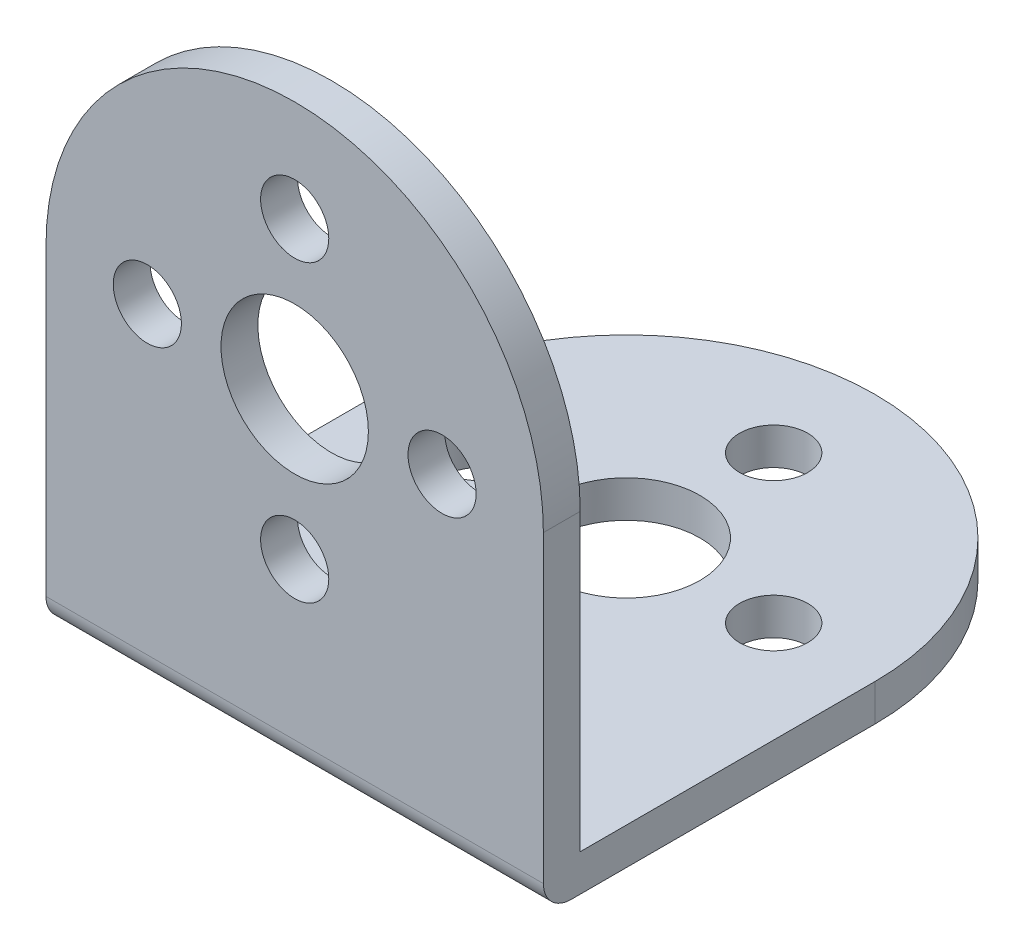
ISO-10303-21;
HEADER;
FILE_DESCRIPTION(('STEP AP214'),'2;1');
FILE_NAME('part.step','',(''),(''),'','','');
FILE_SCHEMA(('AUTOMOTIVE_DESIGN { 1 0 10303 214 1 1 1 1 }'));
ENDSEC;
DATA;
#1=APPLICATION_CONTEXT('core data for automotive mechanical design processes');
#2=APPLICATION_PROTOCOL_DEFINITION('international standard','automotive_design',2000,#1);
#3=PRODUCT_CONTEXT('',#1,'mechanical');
#4=PRODUCT('Part','Part','',(#3));
#5=PRODUCT_RELATED_PRODUCT_CATEGORY('part','',(#4));
#6=PRODUCT_DEFINITION_FORMATION('','',#4);
#7=PRODUCT_DEFINITION_CONTEXT('part definition',#1,'design');
#8=PRODUCT_DEFINITION('design','',#6,#7);
#9=PRODUCT_DEFINITION_SHAPE('','',#8);
#10=(LENGTH_UNIT() NAMED_UNIT(*) SI_UNIT(.MILLI.,.METRE.));
#11=(NAMED_UNIT(*) PLANE_ANGLE_UNIT() SI_UNIT($,.RADIAN.));
#12=(NAMED_UNIT(*) SI_UNIT($,.STERADIAN.) SOLID_ANGLE_UNIT());
#13=UNCERTAINTY_MEASURE_WITH_UNIT(LENGTH_MEASURE(1.E-05),#10,'distance_accuracy_value','');
#14=(GEOMETRIC_REPRESENTATION_CONTEXT(3) GLOBAL_UNCERTAINTY_ASSIGNED_CONTEXT((#13)) GLOBAL_UNIT_ASSIGNED_CONTEXT((#10,
#11,#12)) REPRESENTATION_CONTEXT('',''));
#15=CARTESIAN_POINT('',(0.,0.,0.));
#16=DIRECTION('',(0.,0.,1.));
#17=DIRECTION('',(1.,0.,0.));
#18=AXIS2_PLACEMENT_3D('',#15,#16,#17);
#19=CARTESIAN_POINT('',(0.,2.,-18.));
#20=DIRECTION('',(0.,1.,0.));
#21=DIRECTION('',(0.,0.,1.));
#22=AXIS2_PLACEMENT_3D('',#19,#20,#21);
#23=CYLINDRICAL_SURFACE('',#22,13.5);
#24=DIRECTION('',(0.,-1.,0.));
#25=VECTOR('',#24,1.);
#26=CARTESIAN_POINT('',(-13.5,2.,-18.));
#27=LINE('',#26,#25);
#28=CARTESIAN_POINT('',(-13.5,2.,-18.));
#29=VERTEX_POINT('',#28);
#30=CARTESIAN_POINT('',(-13.5,0.,-18.));
#31=VERTEX_POINT('',#30);
#32=EDGE_CURVE('E151',#29,#31,#27,.T.);
#33=ORIENTED_EDGE('',*,*,#32,.F.);
#34=CARTESIAN_POINT('',(0.,2.,-18.));
#35=DIRECTION('',(0.,1.,0.));
#36=DIRECTION('',(0.,0.,1.));
#37=AXIS2_PLACEMENT_3D('',#34,#35,#36);
#38=CIRCLE('',#37,13.5);
#39=CARTESIAN_POINT('',(13.5,2.,-18.));
#40=VERTEX_POINT('',#39);
#41=EDGE_CURVE('E99',#40,#29,#38,.T.);
#42=ORIENTED_EDGE('',*,*,#41,.F.);
#43=DIRECTION('',(0.,1.,0.));
#44=VECTOR('',#43,1.);
#45=CARTESIAN_POINT('',(13.5,0.,-18.));
#46=LINE('',#45,#44);
#47=CARTESIAN_POINT('',(13.5,0.,-18.));
#48=VERTEX_POINT('',#47);
#49=EDGE_CURVE('E154',#48,#40,#46,.T.);
#50=ORIENTED_EDGE('',*,*,#49,.F.);
#51=CARTESIAN_POINT('',(0.,0.,-18.));
#52=DIRECTION('',(0.,-1.,0.));
#53=DIRECTION('',(0.,0.,-1.));
#54=AXIS2_PLACEMENT_3D('',#51,#52,#53);
#55=CIRCLE('',#54,13.5);
#56=EDGE_CURVE('E160',#31,#48,#55,.T.);
#57=ORIENTED_EDGE('',*,*,#56,.F.);
#58=EDGE_LOOP('',(#33,#42,#50,#57));
#59=FACE_BOUND('',#58,.T.);
#60=ADVANCED_FACE('F16',(#59),#23,.T.);
#61=CARTESIAN_POINT('',(0.,18.,-2.));
#62=DIRECTION('',(0.,0.,1.));
#63=DIRECTION('',(1.,0.,0.));
#64=AXIS2_PLACEMENT_3D('',#61,#62,#63);
#65=CYLINDRICAL_SURFACE('',#64,13.5);
#66=DIRECTION('',(0.,0.,1.));
#67=VECTOR('',#66,1.);
#68=CARTESIAN_POINT('',(13.5,18.,0.));
#69=LINE('',#68,#67);
#70=CARTESIAN_POINT('',(13.5,18.,-2.));
#71=VERTEX_POINT('',#70);
#72=CARTESIAN_POINT('',(13.5,18.,0.));
#73=VERTEX_POINT('',#72);
#74=EDGE_CURVE('E114',#71,#73,#69,.T.);
#75=ORIENTED_EDGE('',*,*,#74,.F.);
#76=CARTESIAN_POINT('',(0.,18.,-2.));
#77=DIRECTION('',(0.,0.,-1.));
#78=DIRECTION('',(0.,1.,0.));
#79=AXIS2_PLACEMENT_3D('',#76,#77,#78);
#80=CIRCLE('',#79,13.5);
#81=CARTESIAN_POINT('',(-13.5,18.,-2.));
#82=VERTEX_POINT('',#81);
#83=EDGE_CURVE('E145',#82,#71,#80,.T.);
#84=ORIENTED_EDGE('',*,*,#83,.F.);
#85=DIRECTION('',(0.,0.,-1.));
#86=VECTOR('',#85,1.);
#87=CARTESIAN_POINT('',(-13.5,18.,-2.));
#88=LINE('',#87,#86);
#89=CARTESIAN_POINT('',(-13.5,18.,0.));
#90=VERTEX_POINT('',#89);
#91=EDGE_CURVE('E120',#90,#82,#88,.T.);
#92=ORIENTED_EDGE('',*,*,#91,.F.);
#93=CARTESIAN_POINT('',(0.,18.,0.));
#94=DIRECTION('',(0.,0.,1.));
#95=DIRECTION('',(0.,-1.,0.));
#96=AXIS2_PLACEMENT_3D('',#93,#94,#95);
#97=CIRCLE('',#96,13.5);
#98=EDGE_CURVE('E148',#73,#90,#97,.T.);
#99=ORIENTED_EDGE('',*,*,#98,.F.);
#100=EDGE_LOOP('',(#75,#84,#92,#99));
#101=FACE_BOUND('',#100,.T.);
#102=ADVANCED_FACE('F530',(#101),#65,.T.);
#103=CARTESIAN_POINT('',(-13.5,31.5,0.));
#104=DIRECTION('',(0.,0.,1.));
#105=DIRECTION('',(0.,-1.,0.));
#106=AXIS2_PLACEMENT_3D('',#103,#104,#105);
#107=PLANE('',#106);
#108=CARTESIAN_POINT('',(0.,26.,0.));
#109=DIRECTION('',(0.,0.,1.));
#110=DIRECTION('',(1.,0.,0.));
#111=AXIS2_PLACEMENT_3D('',#108,#109,#110);
#112=CIRCLE('',#111,1.85);
#113=CARTESIAN_POINT('',(1.85,26.,0.));
#114=VERTEX_POINT('',#113);
#115=EDGE_CURVE('E261',#114,#114,#112,.T.);
#116=ORIENTED_EDGE('',*,*,#115,.F.);
#117=EDGE_LOOP('',(#116));
#118=FACE_BOUND('',#117,.T.);
#119=CARTESIAN_POINT('',(0.,10.,0.));
#120=DIRECTION('',(0.,0.,1.));
#121=DIRECTION('',(1.,0.,0.));
#122=AXIS2_PLACEMENT_3D('',#119,#120,#121);
#123=CIRCLE('',#122,1.85);
#124=CARTESIAN_POINT('',(1.85,10.,0.));
#125=VERTEX_POINT('',#124);
#126=EDGE_CURVE('E248',#125,#125,#123,.T.);
#127=ORIENTED_EDGE('',*,*,#126,.F.);
#128=EDGE_LOOP('',(#127));
#129=FACE_BOUND('',#128,.T.);
#130=CARTESIAN_POINT('',(-8.,18.,0.));
#131=DIRECTION('',(0.,0.,1.));
#132=DIRECTION('',(1.,0.,0.));
#133=AXIS2_PLACEMENT_3D('',#130,#131,#132);
#134=CIRCLE('',#133,1.85);
#135=CARTESIAN_POINT('',(-6.15,18.,0.));
#136=VERTEX_POINT('',#135);
#137=EDGE_CURVE('E235',#136,#136,#134,.T.);
#138=ORIENTED_EDGE('',*,*,#137,.F.);
#139=EDGE_LOOP('',(#138));
#140=FACE_BOUND('',#139,.T.);
#141=CARTESIAN_POINT('',(8.,18.,0.));
#142=DIRECTION('',(0.,0.,1.));
#143=DIRECTION('',(1.,0.,0.));
#144=AXIS2_PLACEMENT_3D('',#141,#142,#143);
#145=CIRCLE('',#144,1.85);
#146=CARTESIAN_POINT('',(9.85,18.,0.));
#147=VERTEX_POINT('',#146);
#148=EDGE_CURVE('E222',#147,#147,#145,.T.);
#149=ORIENTED_EDGE('',*,*,#148,.F.);
#150=EDGE_LOOP('',(#149));
#151=FACE_BOUND('',#150,.T.);
#152=CARTESIAN_POINT('',(0.,18.,0.));
#153=DIRECTION('',(0.,0.,1.));
#154=DIRECTION('',(1.,0.,0.));
#155=AXIS2_PLACEMENT_3D('',#152,#153,#154);
#156=CIRCLE('',#155,4.);
#157=CARTESIAN_POINT('',(4.,18.,0.));
#158=VERTEX_POINT('',#157);
#159=EDGE_CURVE('E131',#158,#158,#156,.T.);
#160=ORIENTED_EDGE('',*,*,#159,.F.);
#161=EDGE_LOOP('',(#160));
#162=FACE_BOUND('',#161,.T.);
#163=DIRECTION('',(0.,-1.,0.));
#164=VECTOR('',#163,1.);
#165=CARTESIAN_POINT('',(-13.5,31.5,0.));
#166=LINE('',#165,#164);
#167=CARTESIAN_POINT('',(-13.5,1.5,0.));
#168=VERTEX_POINT('',#167);
#169=EDGE_CURVE('E138',#90,#168,#166,.T.);
#170=ORIENTED_EDGE('',*,*,#169,.T.);
#171=DIRECTION('',(1.,0.,0.));
#172=VECTOR('',#171,1.);
#173=CARTESIAN_POINT('',(-13.5,1.5,0.));
#174=LINE('',#173,#172);
#175=CARTESIAN_POINT('',(13.5,1.5,0.));
#176=VERTEX_POINT('',#175);
#177=EDGE_CURVE('E164',#168,#176,#174,.T.);
#178=ORIENTED_EDGE('',*,*,#177,.T.);
#179=DIRECTION('',(0.,-1.,0.));
#180=VECTOR('',#179,1.);
#181=CARTESIAN_POINT('',(13.5,31.5,0.));
#182=LINE('',#181,#180);
#183=EDGE_CURVE('E127',#73,#176,#182,.T.);
#184=ORIENTED_EDGE('',*,*,#183,.F.);
#185=ORIENTED_EDGE('',*,*,#98,.T.);
#186=EDGE_LOOP('',(#170,#178,#184,#185));
#187=FACE_BOUND('',#186,.T.);
#188=ADVANCED_FACE('F520',(#118,#129,#140,#151,#162,#187),#107,.T.);
#189=CARTESIAN_POINT('',(-13.5,2.,-2.));
#190=DIRECTION('',(0.,0.,-1.));
#191=DIRECTION('',(0.,1.,0.));
#192=AXIS2_PLACEMENT_3D('',#189,#190,#191);
#193=PLANE('',#192);
#194=CARTESIAN_POINT('',(0.,26.,-2.));
#195=DIRECTION('',(0.,0.,-1.));
#196=DIRECTION('',(0.,1.,0.));
#197=AXIS2_PLACEMENT_3D('',#194,#195,#196);
#198=CIRCLE('',#197,1.85);
#199=CARTESIAN_POINT('',(0.,27.85,-2.));
#200=VERTEX_POINT('',#199);
#201=EDGE_CURVE('E270',#200,#200,#198,.T.);
#202=ORIENTED_EDGE('',*,*,#201,.F.);
#203=EDGE_LOOP('',(#202));
#204=FACE_BOUND('',#203,.T.);
#205=CARTESIAN_POINT('',(0.,10.,-2.));
#206=DIRECTION('',(0.,0.,-1.));
#207=DIRECTION('',(0.,1.,0.));
#208=AXIS2_PLACEMENT_3D('',#205,#206,#207);
#209=CIRCLE('',#208,1.85);
#210=CARTESIAN_POINT('',(0.,11.85,-2.));
#211=VERTEX_POINT('',#210);
#212=EDGE_CURVE('E257',#211,#211,#209,.T.);
#213=ORIENTED_EDGE('',*,*,#212,.F.);
#214=EDGE_LOOP('',(#213));
#215=FACE_BOUND('',#214,.T.);
#216=CARTESIAN_POINT('',(-8.,18.,-2.));
#217=DIRECTION('',(0.,0.,-1.));
#218=DIRECTION('',(0.,1.,0.));
#219=AXIS2_PLACEMENT_3D('',#216,#217,#218);
#220=CIRCLE('',#219,1.85);
#221=CARTESIAN_POINT('',(-8.,19.85,-2.));
#222=VERTEX_POINT('',#221);
#223=EDGE_CURVE('E244',#222,#222,#220,.T.);
#224=ORIENTED_EDGE('',*,*,#223,.F.);
#225=EDGE_LOOP('',(#224));
#226=FACE_BOUND('',#225,.T.);
#227=CARTESIAN_POINT('',(8.,18.,-2.));
#228=DIRECTION('',(0.,0.,-1.));
#229=DIRECTION('',(0.,1.,0.));
#230=AXIS2_PLACEMENT_3D('',#227,#228,#229);
#231=CIRCLE('',#230,1.85);
#232=CARTESIAN_POINT('',(8.,19.85,-2.));
#233=VERTEX_POINT('',#232);
#234=EDGE_CURVE('E231',#233,#233,#231,.T.);
#235=ORIENTED_EDGE('',*,*,#234,.F.);
#236=EDGE_LOOP('',(#235));
#237=FACE_BOUND('',#236,.T.);
#238=CARTESIAN_POINT('',(0.,18.,-2.));
#239=DIRECTION('',(0.,0.,-1.));
#240=DIRECTION('',(0.,1.,0.));
#241=AXIS2_PLACEMENT_3D('',#238,#239,#240);
#242=CIRCLE('',#241,4.);
#243=CARTESIAN_POINT('',(0.,22.,-2.));
#244=VERTEX_POINT('',#243);
#245=EDGE_CURVE('E218',#244,#244,#242,.T.);
#246=ORIENTED_EDGE('',*,*,#245,.F.);
#247=EDGE_LOOP('',(#246));
#248=FACE_BOUND('',#247,.T.);
#249=DIRECTION('',(0.,1.,0.));
#250=VECTOR('',#249,1.);
#251=CARTESIAN_POINT('',(-13.5,2.,-2.));
#252=LINE('',#251,#250);
#253=CARTESIAN_POINT('',(-13.5,2.,-2.));
#254=VERTEX_POINT('',#253);
#255=EDGE_CURVE('E105',#254,#82,#252,.T.);
#256=ORIENTED_EDGE('',*,*,#255,.T.);
#257=ORIENTED_EDGE('',*,*,#83,.T.);
#258=DIRECTION('',(0.,1.,0.));
#259=VECTOR('',#258,1.);
#260=CARTESIAN_POINT('',(13.5,2.,-2.));
#261=LINE('',#260,#259);
#262=CARTESIAN_POINT('',(13.5,2.,-2.));
#263=VERTEX_POINT('',#262);
#264=EDGE_CURVE('E112',#263,#71,#261,.T.);
#265=ORIENTED_EDGE('',*,*,#264,.F.);
#266=DIRECTION('',(1.,0.,0.));
#267=VECTOR('',#266,1.);
#268=CARTESIAN_POINT('',(-13.5,2.,-2.));
#269=LINE('',#268,#267);
#270=EDGE_CURVE('E97',#254,#263,#269,.T.);
#271=ORIENTED_EDGE('',*,*,#270,.F.);
#272=EDGE_LOOP('',(#256,#257,#265,#271));
#273=FACE_BOUND('',#272,.T.);
#274=ADVANCED_FACE('F110',(#204,#215,#226,#237,#248,#273),#193,.T.);
#275=CARTESIAN_POINT('',(-13.5,2.,-31.5));
#276=DIRECTION('',(0.,1.,0.));
#277=DIRECTION('',(0.,0.,1.));
#278=AXIS2_PLACEMENT_3D('',#275,#276,#277);
#279=PLANE('',#278);
#280=CARTESIAN_POINT('',(0.,2.,-10.));
#281=DIRECTION('',(0.,1.,0.));
#282=DIRECTION('',(0.,0.,1.));
#283=AXIS2_PLACEMENT_3D('',#280,#281,#282);
#284=CIRCLE('',#283,1.85);
#285=CARTESIAN_POINT('',(0.,2.,-8.15));
#286=VERTEX_POINT('',#285);
#287=EDGE_CURVE('E335',#286,#286,#284,.T.);
#288=ORIENTED_EDGE('',*,*,#287,.F.);
#289=EDGE_LOOP('',(#288));
#290=FACE_BOUND('',#289,.T.);
#291=CARTESIAN_POINT('',(0.,2.,-26.));
#292=DIRECTION('',(0.,1.,0.));
#293=DIRECTION('',(0.,0.,1.));
#294=AXIS2_PLACEMENT_3D('',#291,#292,#293);
#295=CIRCLE('',#294,1.85);
#296=CARTESIAN_POINT('',(0.,2.,-24.15));
#297=VERTEX_POINT('',#296);
#298=EDGE_CURVE('E322',#297,#297,#295,.T.);
#299=ORIENTED_EDGE('',*,*,#298,.F.);
#300=EDGE_LOOP('',(#299));
#301=FACE_BOUND('',#300,.T.);
#302=CARTESIAN_POINT('',(-8.,2.,-18.));
#303=DIRECTION('',(0.,1.,0.));
#304=DIRECTION('',(0.,0.,1.));
#305=AXIS2_PLACEMENT_3D('',#302,#303,#304);
#306=CIRCLE('',#305,1.85);
#307=CARTESIAN_POINT('',(-8.,2.,-16.15));
#308=VERTEX_POINT('',#307);
#309=EDGE_CURVE('E309',#308,#308,#306,.T.);
#310=ORIENTED_EDGE('',*,*,#309,.F.);
#311=EDGE_LOOP('',(#310));
#312=FACE_BOUND('',#311,.T.);
#313=CARTESIAN_POINT('',(8.,2.,-18.));
#314=DIRECTION('',(0.,1.,0.));
#315=DIRECTION('',(0.,0.,1.));
#316=AXIS2_PLACEMENT_3D('',#313,#314,#315);
#317=CIRCLE('',#316,1.85);
#318=CARTESIAN_POINT('',(8.,2.,-16.15));
#319=VERTEX_POINT('',#318);
#320=EDGE_CURVE('E296',#319,#319,#317,.T.);
#321=ORIENTED_EDGE('',*,*,#320,.F.);
#322=EDGE_LOOP('',(#321));
#323=FACE_BOUND('',#322,.T.);
#324=CARTESIAN_POINT('',(0.,2.,-18.));
#325=DIRECTION('',(0.,1.,0.));
#326=DIRECTION('',(0.,0.,1.));
#327=AXIS2_PLACEMENT_3D('',#324,#325,#326);
#328=CIRCLE('',#327,4.);
#329=CARTESIAN_POINT('',(0.,2.,-14.));
#330=VERTEX_POINT('',#329);
#331=EDGE_CURVE('E283',#330,#330,#328,.T.);
#332=ORIENTED_EDGE('',*,*,#331,.F.);
#333=EDGE_LOOP('',(#332));
#334=FACE_BOUND('',#333,.T.);
#335=DIRECTION('',(0.,0.,1.));
#336=VECTOR('',#335,1.);
#337=CARTESIAN_POINT('',(13.5,2.,-31.5));
#338=LINE('',#337,#336);
#339=EDGE_CURVE('E134',#40,#263,#338,.T.);
#340=ORIENTED_EDGE('',*,*,#339,.F.);
#341=ORIENTED_EDGE('',*,*,#41,.T.);
#342=DIRECTION('',(0.,0.,1.));
#343=VECTOR('',#342,1.);
#344=CARTESIAN_POINT('',(-13.5,2.,-31.5));
#345=LINE('',#344,#343);
#346=EDGE_CURVE('E93',#29,#254,#345,.T.);
#347=ORIENTED_EDGE('',*,*,#346,.T.);
#348=ORIENTED_EDGE('',*,*,#270,.T.);
#349=EDGE_LOOP('',(#340,#341,#347,#348));
#350=FACE_BOUND('',#349,.T.);
#351=ADVANCED_FACE('F96',(#290,#301,#312,#323,#334,#350),#279,.T.);
#352=CARTESIAN_POINT('',(-13.5,0.,0.));
#353=DIRECTION('',(0.,-1.,0.));
#354=DIRECTION('',(0.,0.,-1.));
#355=AXIS2_PLACEMENT_3D('',#352,#353,#354);
#356=PLANE('',#355);
#357=CARTESIAN_POINT('',(0.,0.,-10.));
#358=DIRECTION('',(0.,-1.,0.));
#359=DIRECTION('',(0.,0.,-1.));
#360=AXIS2_PLACEMENT_3D('',#357,#358,#359);
#361=CIRCLE('',#360,1.85);
#362=CARTESIAN_POINT('',(0.,0.,-11.85));
#363=VERTEX_POINT('',#362);
#364=EDGE_CURVE('E326',#363,#363,#361,.T.);
#365=ORIENTED_EDGE('',*,*,#364,.F.);
#366=EDGE_LOOP('',(#365));
#367=FACE_BOUND('',#366,.T.);
#368=CARTESIAN_POINT('',(0.,0.,-26.));
#369=DIRECTION('',(0.,-1.,0.));
#370=DIRECTION('',(0.,0.,-1.));
#371=AXIS2_PLACEMENT_3D('',#368,#369,#370);
#372=CIRCLE('',#371,1.85);
#373=CARTESIAN_POINT('',(0.,0.,-27.85));
#374=VERTEX_POINT('',#373);
#375=EDGE_CURVE('E313',#374,#374,#372,.T.);
#376=ORIENTED_EDGE('',*,*,#375,.F.);
#377=EDGE_LOOP('',(#376));
#378=FACE_BOUND('',#377,.T.);
#379=CARTESIAN_POINT('',(-8.,0.,-18.));
#380=DIRECTION('',(0.,-1.,0.));
#381=DIRECTION('',(0.,0.,-1.));
#382=AXIS2_PLACEMENT_3D('',#379,#380,#381);
#383=CIRCLE('',#382,1.85);
#384=CARTESIAN_POINT('',(-8.,0.,-19.85));
#385=VERTEX_POINT('',#384);
#386=EDGE_CURVE('E300',#385,#385,#383,.T.);
#387=ORIENTED_EDGE('',*,*,#386,.F.);
#388=EDGE_LOOP('',(#387));
#389=FACE_BOUND('',#388,.T.);
#390=CARTESIAN_POINT('',(8.,0.,-18.));
#391=DIRECTION('',(0.,-1.,0.));
#392=DIRECTION('',(0.,0.,-1.));
#393=AXIS2_PLACEMENT_3D('',#390,#391,#392);
#394=CIRCLE('',#393,1.85);
#395=CARTESIAN_POINT('',(8.,0.,-19.85));
#396=VERTEX_POINT('',#395);
#397=EDGE_CURVE('E287',#396,#396,#394,.T.);
#398=ORIENTED_EDGE('',*,*,#397,.F.);
#399=EDGE_LOOP('',(#398));
#400=FACE_BOUND('',#399,.T.);
#401=CARTESIAN_POINT('',(0.,0.,-18.));
#402=DIRECTION('',(0.,-1.,0.));
#403=DIRECTION('',(0.,0.,-1.));
#404=AXIS2_PLACEMENT_3D('',#401,#402,#403);
#405=CIRCLE('',#404,4.);
#406=CARTESIAN_POINT('',(0.,0.,-22.));
#407=VERTEX_POINT('',#406);
#408=EDGE_CURVE('E274',#407,#407,#405,.T.);
#409=ORIENTED_EDGE('',*,*,#408,.F.);
#410=EDGE_LOOP('',(#409));
#411=FACE_BOUND('',#410,.T.);
#412=DIRECTION('',(0.,0.,-1.));
#413=VECTOR('',#412,1.);
#414=CARTESIAN_POINT('',(13.5,0.,0.));
#415=LINE('',#414,#413);
#416=CARTESIAN_POINT('',(13.5,0.,-1.5));
#417=VERTEX_POINT('',#416);
#418=EDGE_CURVE('E130',#417,#48,#415,.T.);
#419=ORIENTED_EDGE('',*,*,#418,.F.);
#420=DIRECTION('',(1.,0.,0.));
#421=VECTOR('',#420,1.);
#422=CARTESIAN_POINT('',(-13.5,0.,-1.5));
#423=LINE('',#422,#421);
#424=CARTESIAN_POINT('',(-13.5,0.,-1.5));
#425=VERTEX_POINT('',#424);
#426=EDGE_CURVE('E25',#417,#425,#423,.F.);
#427=ORIENTED_EDGE('',*,*,#426,.T.);
#428=DIRECTION('',(0.,0.,-1.));
#429=VECTOR('',#428,1.);
#430=CARTESIAN_POINT('',(-13.5,0.,0.));
#431=LINE('',#430,#429);
#432=EDGE_CURVE('E106',#425,#31,#431,.T.);
#433=ORIENTED_EDGE('',*,*,#432,.T.);
#434=ORIENTED_EDGE('',*,*,#56,.T.);
#435=EDGE_LOOP('',(#419,#427,#433,#434));
#436=FACE_BOUND('',#435,.T.);
#437=ADVANCED_FACE('F490',(#367,#378,#389,#400,#411,#436),#356,.T.);
#438=CARTESIAN_POINT('',(-13.5,0.,0.));
#439=DIRECTION('',(1.,0.,0.));
#440=DIRECTION('',(0.,0.,-1.));
#441=AXIS2_PLACEMENT_3D('',#438,#439,#440);
#442=PLANE('',#441);
#443=ORIENTED_EDGE('',*,*,#432,.F.);
#444=CARTESIAN_POINT('',(-13.5,1.5,-1.5));
#445=DIRECTION('',(1.,0.,0.));
#446=DIRECTION('',(0.,0.,-1.));
#447=AXIS2_PLACEMENT_3D('',#444,#445,#446);
#448=CIRCLE('',#447,1.5);
#449=EDGE_CURVE('E10',#425,#168,#448,.F.);
#450=ORIENTED_EDGE('',*,*,#449,.T.);
#451=ORIENTED_EDGE('',*,*,#169,.F.);
#452=ORIENTED_EDGE('',*,*,#91,.T.);
#453=ORIENTED_EDGE('',*,*,#255,.F.);
#454=ORIENTED_EDGE('',*,*,#346,.F.);
#455=ORIENTED_EDGE('',*,*,#32,.T.);
#456=EDGE_LOOP('',(#443,#450,#451,#452,#453,#454,#455));
#457=FACE_BOUND('',#456,.T.);
#458=ADVANCED_FACE('F117',(#457),#442,.F.);
#459=CARTESIAN_POINT('',(13.5,0.,0.));
#460=DIRECTION('',(1.,0.,0.));
#461=DIRECTION('',(0.,0.,-1.));
#462=AXIS2_PLACEMENT_3D('',#459,#460,#461);
#463=PLANE('',#462);
#464=ORIENTED_EDGE('',*,*,#183,.T.);
#465=CARTESIAN_POINT('',(13.5,1.5,-1.5));
#466=DIRECTION('',(1.,0.,0.));
#467=DIRECTION('',(0.,0.,-1.));
#468=AXIS2_PLACEMENT_3D('',#465,#466,#467);
#469=CIRCLE('',#468,1.5);
#470=EDGE_CURVE('E46',#176,#417,#469,.T.);
#471=ORIENTED_EDGE('',*,*,#470,.T.);
#472=ORIENTED_EDGE('',*,*,#418,.T.);
#473=ORIENTED_EDGE('',*,*,#49,.T.);
#474=ORIENTED_EDGE('',*,*,#339,.T.);
#475=ORIENTED_EDGE('',*,*,#264,.T.);
#476=ORIENTED_EDGE('',*,*,#74,.T.);
#477=EDGE_LOOP('',(#464,#471,#472,#473,#474,#475,#476));
#478=FACE_BOUND('',#477,.T.);
#479=ADVANCED_FACE('F468',(#478),#463,.T.);
#480=CARTESIAN_POINT('',(-13.5,1.5,-1.5));
#481=DIRECTION('',(1.,0.,0.));
#482=DIRECTION('',(0.,0.,-1.));
#483=AXIS2_PLACEMENT_3D('',#480,#481,#482);
#484=CYLINDRICAL_SURFACE('',#483,1.5);
#485=ORIENTED_EDGE('',*,*,#449,.F.);
#486=ORIENTED_EDGE('',*,*,#426,.F.);
#487=ORIENTED_EDGE('',*,*,#470,.F.);
#488=ORIENTED_EDGE('',*,*,#177,.F.);
#489=EDGE_LOOP('',(#485,#486,#487,#488));
#490=FACE_BOUND('',#489,.T.);
#491=ADVANCED_FACE('F18',(#490),#484,.T.);
#492=CARTESIAN_POINT('',(0.,18.,-31.5));
#493=DIRECTION('',(0.,0.,1.));
#494=DIRECTION('',(1.,0.,0.));
#495=AXIS2_PLACEMENT_3D('',#492,#493,#494);
#496=CYLINDRICAL_SURFACE('',#495,4.);
#497=ORIENTED_EDGE('',*,*,#245,.T.);
#498=EDGE_LOOP('',(#497));
#499=FACE_BOUND('',#498,.T.);
#500=ORIENTED_EDGE('',*,*,#159,.T.);
#501=EDGE_LOOP('',(#500));
#502=FACE_BOUND('',#501,.T.);
#503=ADVANCED_FACE('F446',(#499,#502),#496,.F.);
#504=CARTESIAN_POINT('',(8.,18.,-31.5));
#505=DIRECTION('',(0.,0.,1.));
#506=DIRECTION('',(1.,0.,0.));
#507=AXIS2_PLACEMENT_3D('',#504,#505,#506);
#508=CYLINDRICAL_SURFACE('',#507,1.85);
#509=ORIENTED_EDGE('',*,*,#234,.T.);
#510=EDGE_LOOP('',(#509));
#511=FACE_BOUND('',#510,.T.);
#512=ORIENTED_EDGE('',*,*,#148,.T.);
#513=EDGE_LOOP('',(#512));
#514=FACE_BOUND('',#513,.T.);
#515=ADVANCED_FACE('F435',(#511,#514),#508,.F.);
#516=CARTESIAN_POINT('',(-8.,18.,-31.5));
#517=DIRECTION('',(0.,0.,1.));
#518=DIRECTION('',(1.,0.,0.));
#519=AXIS2_PLACEMENT_3D('',#516,#517,#518);
#520=CYLINDRICAL_SURFACE('',#519,1.85);
#521=ORIENTED_EDGE('',*,*,#223,.T.);
#522=EDGE_LOOP('',(#521));
#523=FACE_BOUND('',#522,.T.);
#524=ORIENTED_EDGE('',*,*,#137,.T.);
#525=EDGE_LOOP('',(#524));
#526=FACE_BOUND('',#525,.T.);
#527=ADVANCED_FACE('F424',(#523,#526),#520,.F.);
#528=CARTESIAN_POINT('',(0.,10.,-31.5));
#529=DIRECTION('',(0.,0.,1.));
#530=DIRECTION('',(1.,0.,0.));
#531=AXIS2_PLACEMENT_3D('',#528,#529,#530);
#532=CYLINDRICAL_SURFACE('',#531,1.85);
#533=ORIENTED_EDGE('',*,*,#212,.T.);
#534=EDGE_LOOP('',(#533));
#535=FACE_BOUND('',#534,.T.);
#536=ORIENTED_EDGE('',*,*,#126,.T.);
#537=EDGE_LOOP('',(#536));
#538=FACE_BOUND('',#537,.T.);
#539=ADVANCED_FACE('F413',(#535,#538),#532,.F.);
#540=CARTESIAN_POINT('',(0.,26.,-31.5));
#541=DIRECTION('',(0.,0.,1.));
#542=DIRECTION('',(1.,0.,0.));
#543=AXIS2_PLACEMENT_3D('',#540,#541,#542);
#544=CYLINDRICAL_SURFACE('',#543,1.85);
#545=ORIENTED_EDGE('',*,*,#201,.T.);
#546=EDGE_LOOP('',(#545));
#547=FACE_BOUND('',#546,.T.);
#548=ORIENTED_EDGE('',*,*,#115,.T.);
#549=EDGE_LOOP('',(#548));
#550=FACE_BOUND('',#549,.T.);
#551=ADVANCED_FACE('F402',(#547,#550),#544,.F.);
#552=CARTESIAN_POINT('',(0.,31.5,-18.));
#553=DIRECTION('',(0.,-1.,0.));
#554=DIRECTION('',(0.,0.,-1.));
#555=AXIS2_PLACEMENT_3D('',#552,#553,#554);
#556=CYLINDRICAL_SURFACE('',#555,4.);
#557=ORIENTED_EDGE('',*,*,#331,.T.);
#558=EDGE_LOOP('',(#557));
#559=FACE_BOUND('',#558,.T.);
#560=ORIENTED_EDGE('',*,*,#408,.T.);
#561=EDGE_LOOP('',(#560));
#562=FACE_BOUND('',#561,.T.);
#563=ADVANCED_FACE('F391',(#559,#562),#556,.F.);
#564=CARTESIAN_POINT('',(8.,31.5,-18.));
#565=DIRECTION('',(0.,-1.,0.));
#566=DIRECTION('',(0.,0.,-1.));
#567=AXIS2_PLACEMENT_3D('',#564,#565,#566);
#568=CYLINDRICAL_SURFACE('',#567,1.85);
#569=ORIENTED_EDGE('',*,*,#320,.T.);
#570=EDGE_LOOP('',(#569));
#571=FACE_BOUND('',#570,.T.);
#572=ORIENTED_EDGE('',*,*,#397,.T.);
#573=EDGE_LOOP('',(#572));
#574=FACE_BOUND('',#573,.T.);
#575=ADVANCED_FACE('F380',(#571,#574),#568,.F.);
#576=CARTESIAN_POINT('',(-8.,31.5,-18.));
#577=DIRECTION('',(0.,-1.,0.));
#578=DIRECTION('',(0.,0.,-1.));
#579=AXIS2_PLACEMENT_3D('',#576,#577,#578);
#580=CYLINDRICAL_SURFACE('',#579,1.85);
#581=ORIENTED_EDGE('',*,*,#309,.T.);
#582=EDGE_LOOP('',(#581));
#583=FACE_BOUND('',#582,.T.);
#584=ORIENTED_EDGE('',*,*,#386,.T.);
#585=EDGE_LOOP('',(#584));
#586=FACE_BOUND('',#585,.T.);
#587=ADVANCED_FACE('F370',(#583,#586),#580,.F.);
#588=CARTESIAN_POINT('',(0.,31.5,-26.));
#589=DIRECTION('',(0.,-1.,0.));
#590=DIRECTION('',(0.,0.,-1.));
#591=AXIS2_PLACEMENT_3D('',#588,#589,#590);
#592=CYLINDRICAL_SURFACE('',#591,1.85);
#593=ORIENTED_EDGE('',*,*,#298,.T.);
#594=EDGE_LOOP('',(#593));
#595=FACE_BOUND('',#594,.T.);
#596=ORIENTED_EDGE('',*,*,#375,.T.);
#597=EDGE_LOOP('',(#596));
#598=FACE_BOUND('',#597,.T.);
#599=ADVANCED_FACE('F351',(#595,#598),#592,.F.);
#600=CARTESIAN_POINT('',(0.,31.5,-10.));
#601=DIRECTION('',(0.,-1.,0.));
#602=DIRECTION('',(0.,0.,-1.));
#603=AXIS2_PLACEMENT_3D('',#600,#601,#602);
#604=CYLINDRICAL_SURFACE('',#603,1.85);
#605=ORIENTED_EDGE('',*,*,#287,.T.);
#606=EDGE_LOOP('',(#605));
#607=FACE_BOUND('',#606,.T.);
#608=ORIENTED_EDGE('',*,*,#364,.T.);
#609=EDGE_LOOP('',(#608));
#610=FACE_BOUND('',#609,.T.);
#611=ADVANCED_FACE('F346',(#607,#610),#604,.F.);
#612=CLOSED_SHELL('',(#60,#102,#188,#274,#351,#437,#458,#479,#491,#503,#515,#527,#539,#551,#563,
#575,#587,#599,#611));
#613=MANIFOLD_SOLID_BREP('B1',#612);
#614=ADVANCED_BREP_SHAPE_REPRESENTATION('',(#18,#613),#14);
#615=SHAPE_DEFINITION_REPRESENTATION(#9,#614);
ENDSEC;
END-ISO-10303-21;
